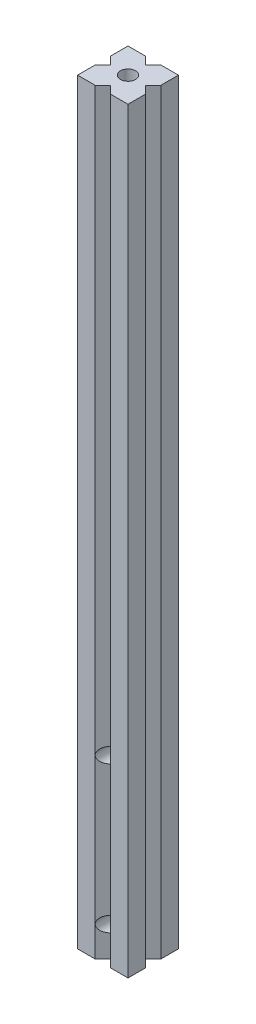
ISO-10303-21;
HEADER;
FILE_DESCRIPTION(('STEP AP214'),'2;1');
FILE_NAME('part.step','',(''),(''),'','','');
FILE_SCHEMA(('AUTOMOTIVE_DESIGN { 1 0 10303 214 1 1 1 1 }'));
ENDSEC;
DATA;
#1=APPLICATION_CONTEXT('core data for automotive mechanical design processes');
#2=APPLICATION_PROTOCOL_DEFINITION('international standard','automotive_design',2000,#1);
#3=PRODUCT_CONTEXT('',#1,'mechanical');
#4=PRODUCT('Part','Part','',(#3));
#5=PRODUCT_RELATED_PRODUCT_CATEGORY('part','',(#4));
#6=PRODUCT_DEFINITION_FORMATION('','',#4);
#7=PRODUCT_DEFINITION_CONTEXT('part definition',#1,'design');
#8=PRODUCT_DEFINITION('design','',#6,#7);
#9=PRODUCT_DEFINITION_SHAPE('','',#8);
#10=(LENGTH_UNIT() NAMED_UNIT(*) SI_UNIT(.MILLI.,.METRE.));
#11=(NAMED_UNIT(*) PLANE_ANGLE_UNIT() SI_UNIT($,.RADIAN.));
#12=(NAMED_UNIT(*) SI_UNIT($,.STERADIAN.) SOLID_ANGLE_UNIT());
#13=UNCERTAINTY_MEASURE_WITH_UNIT(LENGTH_MEASURE(1.E-05),#10,'distance_accuracy_value','');
#14=(GEOMETRIC_REPRESENTATION_CONTEXT(3) GLOBAL_UNCERTAINTY_ASSIGNED_CONTEXT((#13)) GLOBAL_UNIT_ASSIGNED_CONTEXT((#10,
#11,#12)) REPRESENTATION_CONTEXT('',''));
#15=CARTESIAN_POINT('',(0.,0.,0.));
#16=DIRECTION('',(0.,0.,1.));
#17=DIRECTION('',(1.,0.,0.));
#18=AXIS2_PLACEMENT_3D('',#15,#16,#17);
#19=CARTESIAN_POINT('',(7.,0.,0.));
#20=DIRECTION('',(-0.707106781186548,0.,-0.707106781186547));
#21=DIRECTION('',(-0.707106781186547,0.,0.707106781186548));
#22=AXIS2_PLACEMENT_3D('',#19,#20,#21);
#23=PLANE('',#22);
#24=DIRECTION('',(0.,1.,0.));
#25=VECTOR('',#24,1.);
#26=CARTESIAN_POINT('',(7.,0.,0.));
#27=LINE('',#26,#25);
#28=CARTESIAN_POINT('',(7.,12.,0.));
#29=VERTEX_POINT('',#28);
#30=CARTESIAN_POINT('',(7.,70.,0.));
#31=VERTEX_POINT('',#30);
#32=EDGE_CURVE('E349',#29,#31,#27,.T.);
#33=ORIENTED_EDGE('',*,*,#32,.F.);
#34=CARTESIAN_POINT('',(10.,12.,-3.));
#35=DIRECTION('',(-0.707106781186548,0.,-0.707106781186547));
#36=DIRECTION('',(-0.707106781186547,0.,0.707106781186548));
#37=AXIS2_PLACEMENT_3D('',#34,#35,#36);
#38=ELLIPSE('',#37,4.24264068711929,3.);
#39=CARTESIAN_POINT('',(10.,15.,-3.));
#40=VERTEX_POINT('',#39);
#41=EDGE_CURVE('E849',#29,#40,#38,.T.);
#42=ORIENTED_EDGE('',*,*,#41,.T.);
#43=DIRECTION('',(0.,1.,0.));
#44=VECTOR('',#43,1.);
#45=CARTESIAN_POINT('',(10.,0.,-3.));
#46=LINE('',#45,#44);
#47=CARTESIAN_POINT('',(10.,67.,-3.));
#48=VERTEX_POINT('',#47);
#49=EDGE_CURVE('E337',#40,#48,#46,.T.);
#50=ORIENTED_EDGE('',*,*,#49,.T.);
#51=CARTESIAN_POINT('',(10.,70.,-3.));
#52=DIRECTION('',(-0.707106781186548,0.,-0.707106781186547));
#53=DIRECTION('',(-0.707106781186547,0.,0.707106781186548));
#54=AXIS2_PLACEMENT_3D('',#51,#52,#53);
#55=ELLIPSE('',#54,4.24264068711929,3.);
#56=EDGE_CURVE('E863',#48,#31,#55,.T.);
#57=ORIENTED_EDGE('',*,*,#56,.T.);
#58=EDGE_LOOP('',(#33,#42,#50,#57));
#59=FACE_BOUND('',#58,.T.);
#60=ADVANCED_FACE('F43',(#59),#23,.F.);
#61=CARTESIAN_POINT('',(7.,300.,0.));
#62=VERTEX_POINT('',#61);
#63=EDGE_CURVE('E325',#31,#62,#27,.T.);
#64=ORIENTED_EDGE('',*,*,#63,.F.);
#65=CARTESIAN_POINT('',(10.,73.,-3.));
#66=VERTEX_POINT('',#65);
#67=EDGE_CURVE('E862',#31,#66,#55,.T.);
#68=ORIENTED_EDGE('',*,*,#67,.T.);
#69=CARTESIAN_POINT('',(10.,300.,-3.));
#70=VERTEX_POINT('',#69);
#71=EDGE_CURVE('E338',#66,#70,#46,.T.);
#72=ORIENTED_EDGE('',*,*,#71,.T.);
#73=DIRECTION('',(-0.707106781186547,0.,0.707106781186548));
#74=VECTOR('',#73,1.);
#75=CARTESIAN_POINT('',(7.,300.,0.));
#76=LINE('',#75,#74);
#77=EDGE_CURVE('E326',#70,#62,#76,.T.);
#78=ORIENTED_EDGE('',*,*,#77,.T.);
#79=EDGE_LOOP('',(#64,#68,#72,#78));
#80=FACE_BOUND('',#79,.T.);
#81=ADVANCED_FACE('F448',(#80),#23,.F.);
#82=CARTESIAN_POINT('',(13.,0.,0.));
#83=DIRECTION('',(0.707106781186548,0.,-0.707106781186547));
#84=DIRECTION('',(-0.707106781186547,0.,-0.707106781186548));
#85=AXIS2_PLACEMENT_3D('',#82,#83,#84);
#86=PLANE('',#85);
#87=DIRECTION('',(0.,1.,0.));
#88=VECTOR('',#87,1.);
#89=CARTESIAN_POINT('',(13.,0.,0.));
#90=LINE('',#89,#88);
#91=CARTESIAN_POINT('',(13.,0.,0.));
#92=VERTEX_POINT('',#91);
#93=CARTESIAN_POINT('',(13.,12.,0.));
#94=VERTEX_POINT('',#93);
#95=EDGE_CURVE('E339',#92,#94,#90,.T.);
#96=ORIENTED_EDGE('',*,*,#95,.T.);
#97=CARTESIAN_POINT('',(10.,12.,-3.));
#98=DIRECTION('',(0.707106781186548,0.,-0.707106781186547));
#99=DIRECTION('',(0.707106781186547,0.,0.707106781186548));
#100=AXIS2_PLACEMENT_3D('',#97,#98,#99);
#101=ELLIPSE('',#100,4.24264068711929,3.);
#102=CARTESIAN_POINT('',(10.,9.,-3.));
#103=VERTEX_POINT('',#102);
#104=EDGE_CURVE('E483',#94,#103,#101,.T.);
#105=ORIENTED_EDGE('',*,*,#104,.T.);
#106=CARTESIAN_POINT('',(10.,0.,-3.));
#107=VERTEX_POINT('',#106);
#108=EDGE_CURVE('E305',#107,#103,#46,.T.);
#109=ORIENTED_EDGE('',*,*,#108,.F.);
#110=DIRECTION('',(-0.707106781186547,0.,-0.707106781186548));
#111=VECTOR('',#110,1.);
#112=CARTESIAN_POINT('',(13.,0.,0.));
#113=LINE('',#112,#111);
#114=EDGE_CURVE('E320',#92,#107,#113,.T.);
#115=ORIENTED_EDGE('',*,*,#114,.F.);
#116=EDGE_LOOP('',(#96,#105,#109,#115));
#117=FACE_BOUND('',#116,.T.);
#118=ADVANCED_FACE('F457',(#117),#86,.F.);
#119=ORIENTED_EDGE('',*,*,#49,.F.);
#120=EDGE_CURVE('E853',#40,#94,#101,.T.);
#121=ORIENTED_EDGE('',*,*,#120,.T.);
#122=CARTESIAN_POINT('',(13.,70.,0.));
#123=VERTEX_POINT('',#122);
#124=EDGE_CURVE('E343',#94,#123,#90,.T.);
#125=ORIENTED_EDGE('',*,*,#124,.T.);
#126=CARTESIAN_POINT('',(10.,70.,-3.));
#127=DIRECTION('',(0.707106781186548,0.,-0.707106781186547));
#128=DIRECTION('',(0.707106781186547,0.,0.707106781186548));
#129=AXIS2_PLACEMENT_3D('',#126,#127,#128);
#130=ELLIPSE('',#129,4.24264068711929,3.);
#131=EDGE_CURVE('E866',#123,#48,#130,.T.);
#132=ORIENTED_EDGE('',*,*,#131,.T.);
#133=EDGE_LOOP('',(#119,#121,#125,#132));
#134=FACE_BOUND('',#133,.T.);
#135=ADVANCED_FACE('F472',(#134),#86,.F.);
#136=CARTESIAN_POINT('',(13.,0.,-20.));
#137=DIRECTION('',(0.707106781186547,0.,0.707106781186548));
#138=DIRECTION('',(0.707106781186548,0.,-0.707106781186547));
#139=AXIS2_PLACEMENT_3D('',#136,#137,#138);
#140=PLANE('',#139);
#141=DIRECTION('',(0.,1.,0.));
#142=VECTOR('',#141,1.);
#143=CARTESIAN_POINT('',(10.,0.,-17.));
#144=LINE('',#143,#142);
#145=CARTESIAN_POINT('',(10.,0.,-17.));
#146=VERTEX_POINT('',#145);
#147=CARTESIAN_POINT('',(10.,9.,-17.));
#148=VERTEX_POINT('',#147);
#149=EDGE_CURVE('E246',#146,#148,#144,.T.);
#150=ORIENTED_EDGE('',*,*,#149,.T.);
#151=CARTESIAN_POINT('',(10.,12.,-17.));
#152=DIRECTION('',(0.707106781186547,0.,0.707106781186548));
#153=DIRECTION('',(-0.707106781186548,0.,0.707106781186547));
#154=AXIS2_PLACEMENT_3D('',#151,#152,#153);
#155=ELLIPSE('',#154,4.24264068711929,3.);
#156=CARTESIAN_POINT('',(13.,12.,-20.));
#157=VERTEX_POINT('',#156);
#158=EDGE_CURVE('E856',#148,#157,#155,.T.);
#159=ORIENTED_EDGE('',*,*,#158,.T.);
#160=DIRECTION('',(0.,1.,0.));
#161=VECTOR('',#160,1.);
#162=CARTESIAN_POINT('',(13.,0.,-20.));
#163=LINE('',#162,#161);
#164=CARTESIAN_POINT('',(13.,0.,-20.));
#165=VERTEX_POINT('',#164);
#166=EDGE_CURVE('E248',#165,#157,#163,.T.);
#167=ORIENTED_EDGE('',*,*,#166,.F.);
#168=DIRECTION('',(0.707106781186548,0.,-0.707106781186547));
#169=VECTOR('',#168,1.);
#170=CARTESIAN_POINT('',(13.,0.,-20.));
#171=LINE('',#170,#169);
#172=EDGE_CURVE('E837',#146,#165,#171,.T.);
#173=ORIENTED_EDGE('',*,*,#172,.F.);
#174=EDGE_LOOP('',(#150,#159,#167,#173));
#175=FACE_BOUND('',#174,.T.);
#176=ADVANCED_FACE('F657',(#175),#140,.F.);
#177=CARTESIAN_POINT('',(13.,70.,-20.));
#178=VERTEX_POINT('',#177);
#179=EDGE_CURVE('E233',#157,#178,#163,.T.);
#180=ORIENTED_EDGE('',*,*,#179,.F.);
#181=CARTESIAN_POINT('',(10.,15.,-17.));
#182=VERTEX_POINT('',#181);
#183=EDGE_CURVE('E857',#157,#182,#155,.T.);
#184=ORIENTED_EDGE('',*,*,#183,.T.);
#185=CARTESIAN_POINT('',(10.,67.,-17.));
#186=VERTEX_POINT('',#185);
#187=EDGE_CURVE('E236',#182,#186,#144,.T.);
#188=ORIENTED_EDGE('',*,*,#187,.T.);
#189=CARTESIAN_POINT('',(10.,70.,-17.));
#190=DIRECTION('',(0.707106781186547,0.,0.707106781186548));
#191=DIRECTION('',(-0.707106781186548,0.,0.707106781186547));
#192=AXIS2_PLACEMENT_3D('',#189,#190,#191);
#193=ELLIPSE('',#192,4.24264068711929,3.);
#194=EDGE_CURVE('E219',#186,#178,#193,.T.);
#195=ORIENTED_EDGE('',*,*,#194,.T.);
#196=EDGE_LOOP('',(#180,#184,#188,#195));
#197=FACE_BOUND('',#196,.T.);
#198=ADVANCED_FACE('F230',(#197),#140,.F.);
#199=CARTESIAN_POINT('',(7.,0.,-20.));
#200=DIRECTION('',(-0.707106781186547,0.,0.707106781186548));
#201=DIRECTION('',(0.707106781186548,0.,0.707106781186547));
#202=AXIS2_PLACEMENT_3D('',#199,#200,#201);
#203=PLANE('',#202);
#204=ORIENTED_EDGE('',*,*,#187,.F.);
#205=CARTESIAN_POINT('',(10.,12.,-17.));
#206=DIRECTION('',(-0.707106781186547,0.,0.707106781186548));
#207=DIRECTION('',(0.707106781186548,0.,0.707106781186547));
#208=AXIS2_PLACEMENT_3D('',#205,#206,#207);
#209=ELLIPSE('',#208,4.24264068711929,3.);
#210=CARTESIAN_POINT('',(7.,12.,-20.));
#211=VERTEX_POINT('',#210);
#212=EDGE_CURVE('E824',#182,#211,#209,.T.);
#213=ORIENTED_EDGE('',*,*,#212,.T.);
#214=DIRECTION('',(0.,1.,0.));
#215=VECTOR('',#214,1.);
#216=CARTESIAN_POINT('',(7.,0.,-20.));
#217=LINE('',#216,#215);
#218=CARTESIAN_POINT('',(7.,70.,-20.));
#219=VERTEX_POINT('',#218);
#220=EDGE_CURVE('E264',#211,#219,#217,.T.);
#221=ORIENTED_EDGE('',*,*,#220,.T.);
#222=CARTESIAN_POINT('',(10.,70.,-17.));
#223=DIRECTION('',(-0.707106781186547,0.,0.707106781186548));
#224=DIRECTION('',(0.707106781186548,0.,0.707106781186547));
#225=AXIS2_PLACEMENT_3D('',#222,#223,#224);
#226=ELLIPSE('',#225,4.24264068711929,3.);
#227=EDGE_CURVE('E826',#219,#186,#226,.T.);
#228=ORIENTED_EDGE('',*,*,#227,.T.);
#229=EDGE_LOOP('',(#204,#213,#221,#228));
#230=FACE_BOUND('',#229,.T.);
#231=ADVANCED_FACE('F648',(#230),#203,.F.);
#232=CARTESIAN_POINT('',(10.,73.,-17.));
#233=VERTEX_POINT('',#232);
#234=CARTESIAN_POINT('',(10.,300.,-17.));
#235=VERTEX_POINT('',#234);
#236=EDGE_CURVE('E259',#233,#235,#144,.T.);
#237=ORIENTED_EDGE('',*,*,#236,.F.);
#238=EDGE_CURVE('E222',#233,#219,#226,.T.);
#239=ORIENTED_EDGE('',*,*,#238,.T.);
#240=CARTESIAN_POINT('',(7.,300.,-20.));
#241=VERTEX_POINT('',#240);
#242=EDGE_CURVE('E265',#219,#241,#217,.T.);
#243=ORIENTED_EDGE('',*,*,#242,.T.);
#244=DIRECTION('',(0.707106781186548,0.,0.707106781186547));
#245=VECTOR('',#244,1.);
#246=CARTESIAN_POINT('',(7.,300.,-20.));
#247=LINE('',#246,#245);
#248=EDGE_CURVE('E287',#241,#235,#247,.T.);
#249=ORIENTED_EDGE('',*,*,#248,.T.);
#250=EDGE_LOOP('',(#237,#239,#243,#249));
#251=FACE_BOUND('',#250,.T.);
#252=ADVANCED_FACE('F443',(#251),#203,.F.);
#253=CARTESIAN_POINT('',(10.,0.,-10.));
#254=DIRECTION('',(0.,1.,0.));
#255=DIRECTION('',(0.,0.,1.));
#256=AXIS2_PLACEMENT_3D('',#253,#254,#255);
#257=CYLINDRICAL_SURFACE('',#256,3.);
#258=CARTESIAN_POINT('',(10.,300.,-10.));
#259=DIRECTION('',(0.,1.,0.));
#260=DIRECTION('',(0.,0.,1.));
#261=AXIS2_PLACEMENT_3D('',#258,#259,#260);
#262=CIRCLE('',#261,3.);
#263=CARTESIAN_POINT('',(10.,300.,-7.));
#264=VERTEX_POINT('',#263);
#265=EDGE_CURVE('E846',#264,#264,#262,.T.);
#266=ORIENTED_EDGE('',*,*,#265,.T.);
#267=EDGE_LOOP('',(#266));
#268=FACE_BOUND('',#267,.T.);
#269=CARTESIAN_POINT('',(10.,70.,-10.));
#270=DIRECTION('',(0.,0.707106781186547,-0.707106781186547));
#271=DIRECTION('',(0.,0.707106781186547,0.707106781186547));
#272=AXIS2_PLACEMENT_3D('',#269,#270,#271);
#273=ELLIPSE('',#272,4.24264068711929,3.);
#274=CARTESIAN_POINT('',(13.,70.,-10.));
#275=VERTEX_POINT('',#274);
#276=CARTESIAN_POINT('',(7.,70.,-10.));
#277=VERTEX_POINT('',#276);
#278=EDGE_CURVE('E63',#275,#277,#273,.F.);
#279=ORIENTED_EDGE('',*,*,#278,.T.);
#280=CARTESIAN_POINT('',(10.,70.,-10.));
#281=DIRECTION('',(0.,0.707106781186547,0.707106781186547));
#282=DIRECTION('',(0.,0.707106781186547,-0.707106781186547));
#283=AXIS2_PLACEMENT_3D('',#280,#281,#282);
#284=ELLIPSE('',#283,4.24264068711929,3.);
#285=EDGE_CURVE('E410',#277,#275,#284,.F.);
#286=ORIENTED_EDGE('',*,*,#285,.T.);
#287=EDGE_LOOP('',(#279,#286));
#288=FACE_BOUND('',#287,.T.);
#289=ADVANCED_FACE('F431',(#268,#288),#257,.F.);
#290=CARTESIAN_POINT('',(0.,300.,0.));
#291=DIRECTION('',(1.,0.,0.));
#292=DIRECTION('',(0.,0.,-1.));
#293=AXIS2_PLACEMENT_3D('',#290,#291,#292);
#294=PLANE('',#293);
#295=DIRECTION('',(0.,0.,1.));
#296=VECTOR('',#295,1.);
#297=CARTESIAN_POINT('',(0.,300.,0.));
#298=LINE('',#297,#296);
#299=CARTESIAN_POINT('',(0.,300.,-7.));
#300=VERTEX_POINT('',#299);
#301=CARTESIAN_POINT('',(0.,300.,0.));
#302=VERTEX_POINT('',#301);
#303=EDGE_CURVE('E355',#300,#302,#298,.T.);
#304=ORIENTED_EDGE('',*,*,#303,.F.);
#305=DIRECTION('',(0.,1.,0.));
#306=VECTOR('',#305,1.);
#307=CARTESIAN_POINT('',(0.,0.,-7.));
#308=LINE('',#307,#306);
#309=CARTESIAN_POINT('',(0.,0.,-7.));
#310=VERTEX_POINT('',#309);
#311=EDGE_CURVE('E280',#310,#300,#308,.T.);
#312=ORIENTED_EDGE('',*,*,#311,.F.);
#313=DIRECTION('',(0.,0.,1.));
#314=VECTOR('',#313,1.);
#315=CARTESIAN_POINT('',(0.,0.,0.));
#316=LINE('',#315,#314);
#317=CARTESIAN_POINT('',(0.,0.,0.));
#318=VERTEX_POINT('',#317);
#319=EDGE_CURVE('E252',#310,#318,#316,.T.);
#320=ORIENTED_EDGE('',*,*,#319,.T.);
#321=DIRECTION('',(0.,-1.,0.));
#322=VECTOR('',#321,1.);
#323=CARTESIAN_POINT('',(0.,300.,0.));
#324=LINE('',#323,#322);
#325=EDGE_CURVE('E399',#302,#318,#324,.T.);
#326=ORIENTED_EDGE('',*,*,#325,.F.);
#327=EDGE_LOOP('',(#304,#312,#320,#326));
#328=FACE_BOUND('',#327,.T.);
#329=ADVANCED_FACE('F442',(#328),#294,.F.);
#330=CARTESIAN_POINT('',(0.,300.,0.));
#331=DIRECTION('',(0.,0.,-1.));
#332=DIRECTION('',(-1.,0.,0.));
#333=AXIS2_PLACEMENT_3D('',#330,#331,#332);
#334=PLANE('',#333);
#335=DIRECTION('',(1.,0.,0.));
#336=VECTOR('',#335,1.);
#337=CARTESIAN_POINT('',(0.,0.,0.));
#338=LINE('',#337,#336);
#339=CARTESIAN_POINT('',(7.,0.,0.));
#340=VERTEX_POINT('',#339);
#341=EDGE_CURVE('E375',#318,#340,#338,.T.);
#342=ORIENTED_EDGE('',*,*,#341,.T.);
#343=EDGE_CURVE('E345',#340,#29,#27,.T.);
#344=ORIENTED_EDGE('',*,*,#343,.T.);
#345=ORIENTED_EDGE('',*,*,#32,.T.);
#346=ORIENTED_EDGE('',*,*,#63,.T.);
#347=DIRECTION('',(1.,0.,0.));
#348=VECTOR('',#347,1.);
#349=CARTESIAN_POINT('',(0.,300.,0.));
#350=LINE('',#349,#348);
#351=EDGE_CURVE('E356',#302,#62,#350,.T.);
#352=ORIENTED_EDGE('',*,*,#351,.F.);
#353=ORIENTED_EDGE('',*,*,#325,.T.);
#354=EDGE_LOOP('',(#342,#344,#345,#346,#352,#353));
#355=FACE_BOUND('',#354,.T.);
#356=ADVANCED_FACE('F501',(#355),#334,.F.);
#357=CARTESIAN_POINT('',(20.,300.,0.));
#358=DIRECTION('',(-1.,0.,0.));
#359=DIRECTION('',(0.,0.,1.));
#360=AXIS2_PLACEMENT_3D('',#357,#358,#359);
#361=PLANE('',#360);
#362=DIRECTION('',(0.,0.,-1.));
#363=VECTOR('',#362,1.);
#364=CARTESIAN_POINT('',(20.,0.,0.));
#365=LINE('',#364,#363);
#366=CARTESIAN_POINT('',(20.,0.,0.));
#367=VERTEX_POINT('',#366);
#368=CARTESIAN_POINT('',(20.,0.,-7.));
#369=VERTEX_POINT('',#368);
#370=EDGE_CURVE('E380',#367,#369,#365,.T.);
#371=ORIENTED_EDGE('',*,*,#370,.T.);
#372=DIRECTION('',(0.,1.,0.));
#373=VECTOR('',#372,1.);
#374=CARTESIAN_POINT('',(20.,0.,-7.));
#375=LINE('',#374,#373);
#376=CARTESIAN_POINT('',(20.,300.,-7.));
#377=VERTEX_POINT('',#376);
#378=EDGE_CURVE('E283',#369,#377,#375,.T.);
#379=ORIENTED_EDGE('',*,*,#378,.T.);
#380=DIRECTION('',(0.,0.,-1.));
#381=VECTOR('',#380,1.);
#382=CARTESIAN_POINT('',(20.,300.,0.));
#383=LINE('',#382,#381);
#384=CARTESIAN_POINT('',(20.,300.,0.));
#385=VERTEX_POINT('',#384);
#386=EDGE_CURVE('E361',#385,#377,#383,.T.);
#387=ORIENTED_EDGE('',*,*,#386,.F.);
#388=DIRECTION('',(0.,-1.,0.));
#389=VECTOR('',#388,1.);
#390=CARTESIAN_POINT('',(20.,300.,0.));
#391=LINE('',#390,#389);
#392=EDGE_CURVE('E395',#385,#367,#391,.T.);
#393=ORIENTED_EDGE('',*,*,#392,.T.);
#394=EDGE_LOOP('',(#371,#379,#387,#393));
#395=FACE_BOUND('',#394,.T.);
#396=ADVANCED_FACE('F520',(#395),#361,.F.);
#397=CARTESIAN_POINT('',(0.,300.,-20.));
#398=DIRECTION('',(0.,0.,1.));
#399=DIRECTION('',(1.,0.,0.));
#400=AXIS2_PLACEMENT_3D('',#397,#398,#399);
#401=PLANE('',#400);
#402=DIRECTION('',(-1.,0.,0.));
#403=VECTOR('',#402,1.);
#404=CARTESIAN_POINT('',(0.,0.,-20.));
#405=LINE('',#404,#403);
#406=CARTESIAN_POINT('',(20.,0.,-20.));
#407=VERTEX_POINT('',#406);
#408=EDGE_CURVE('E385',#407,#165,#405,.T.);
#409=ORIENTED_EDGE('',*,*,#408,.T.);
#410=ORIENTED_EDGE('',*,*,#166,.T.);
#411=ORIENTED_EDGE('',*,*,#179,.T.);
#412=CARTESIAN_POINT('',(13.,300.,-20.));
#413=VERTEX_POINT('',#412);
#414=EDGE_CURVE('E239',#178,#413,#163,.T.);
#415=ORIENTED_EDGE('',*,*,#414,.T.);
#416=DIRECTION('',(-1.,0.,0.));
#417=VECTOR('',#416,1.);
#418=CARTESIAN_POINT('',(0.,300.,-20.));
#419=LINE('',#418,#417);
#420=CARTESIAN_POINT('',(20.,300.,-20.));
#421=VERTEX_POINT('',#420);
#422=EDGE_CURVE('E366',#421,#413,#419,.T.);
#423=ORIENTED_EDGE('',*,*,#422,.F.);
#424=DIRECTION('',(0.,-1.,0.));
#425=VECTOR('',#424,1.);
#426=CARTESIAN_POINT('',(20.,300.,-20.));
#427=LINE('',#426,#425);
#428=EDGE_CURVE('E391',#421,#407,#427,.T.);
#429=ORIENTED_EDGE('',*,*,#428,.T.);
#430=EDGE_LOOP('',(#409,#410,#411,#415,#423,#429));
#431=FACE_BOUND('',#430,.T.);
#432=ADVANCED_FACE('F250',(#431),#401,.F.);
#433=CARTESIAN_POINT('',(0.,0.,-20.));
#434=VERTEX_POINT('',#433);
#435=CARTESIAN_POINT('',(0.,0.,-13.));
#436=VERTEX_POINT('',#435);
#437=EDGE_CURVE('E370',#434,#436,#316,.T.);
#438=ORIENTED_EDGE('',*,*,#437,.T.);
#439=DIRECTION('',(0.,1.,0.));
#440=VECTOR('',#439,1.);
#441=CARTESIAN_POINT('',(0.,0.,-13.));
#442=LINE('',#441,#440);
#443=CARTESIAN_POINT('',(0.,300.,-13.));
#444=VERTEX_POINT('',#443);
#445=EDGE_CURVE('E310',#436,#444,#442,.T.);
#446=ORIENTED_EDGE('',*,*,#445,.T.);
#447=CARTESIAN_POINT('',(0.,300.,-20.));
#448=VERTEX_POINT('',#447);
#449=EDGE_CURVE('E350',#448,#444,#298,.T.);
#450=ORIENTED_EDGE('',*,*,#449,.F.);
#451=DIRECTION('',(0.,-1.,0.));
#452=VECTOR('',#451,1.);
#453=CARTESIAN_POINT('',(0.,300.,-20.));
#454=LINE('',#453,#452);
#455=EDGE_CURVE('E369',#448,#434,#454,.T.);
#456=ORIENTED_EDGE('',*,*,#455,.T.);
#457=EDGE_LOOP('',(#438,#446,#450,#456));
#458=FACE_BOUND('',#457,.T.);
#459=ADVANCED_FACE('F45',(#458),#294,.F.);
#460=CARTESIAN_POINT('',(13.,300.,0.));
#461=VERTEX_POINT('',#460);
#462=EDGE_CURVE('E354',#461,#385,#350,.T.);
#463=ORIENTED_EDGE('',*,*,#462,.F.);
#464=EDGE_CURVE('E344',#123,#461,#90,.T.);
#465=ORIENTED_EDGE('',*,*,#464,.F.);
#466=ORIENTED_EDGE('',*,*,#124,.F.);
#467=ORIENTED_EDGE('',*,*,#95,.F.);
#468=EDGE_CURVE('E374',#92,#367,#338,.T.);
#469=ORIENTED_EDGE('',*,*,#468,.T.);
#470=ORIENTED_EDGE('',*,*,#392,.F.);
#471=EDGE_LOOP('',(#463,#465,#466,#467,#469,#470));
#472=FACE_BOUND('',#471,.T.);
#473=ADVANCED_FACE('F509',(#472),#334,.F.);
#474=CARTESIAN_POINT('',(20.,300.,-13.));
#475=VERTEX_POINT('',#474);
#476=EDGE_CURVE('E360',#475,#421,#383,.T.);
#477=ORIENTED_EDGE('',*,*,#476,.F.);
#478=DIRECTION('',(0.,1.,0.));
#479=VECTOR('',#478,1.);
#480=CARTESIAN_POINT('',(20.,0.,-13.));
#481=LINE('',#480,#479);
#482=CARTESIAN_POINT('',(20.,0.,-13.));
#483=VERTEX_POINT('',#482);
#484=EDGE_CURVE('E275',#483,#475,#481,.T.);
#485=ORIENTED_EDGE('',*,*,#484,.F.);
#486=EDGE_CURVE('E379',#483,#407,#365,.T.);
#487=ORIENTED_EDGE('',*,*,#486,.T.);
#488=ORIENTED_EDGE('',*,*,#428,.F.);
#489=EDGE_LOOP('',(#477,#485,#487,#488));
#490=FACE_BOUND('',#489,.T.);
#491=ADVANCED_FACE('F514',(#490),#361,.F.);
#492=EDGE_CURVE('E365',#241,#448,#419,.T.);
#493=ORIENTED_EDGE('',*,*,#492,.F.);
#494=ORIENTED_EDGE('',*,*,#242,.F.);
#495=ORIENTED_EDGE('',*,*,#220,.F.);
#496=CARTESIAN_POINT('',(7.,0.,-20.));
#497=VERTEX_POINT('',#496);
#498=EDGE_CURVE('E260',#497,#211,#217,.T.);
#499=ORIENTED_EDGE('',*,*,#498,.F.);
#500=EDGE_CURVE('E384',#497,#434,#405,.T.);
#501=ORIENTED_EDGE('',*,*,#500,.T.);
#502=ORIENTED_EDGE('',*,*,#455,.F.);
#503=EDGE_LOOP('',(#493,#494,#495,#499,#501,#502));
#504=FACE_BOUND('',#503,.T.);
#505=ADVANCED_FACE('F517',(#504),#401,.F.);
#506=CARTESIAN_POINT('',(0.,300.,0.));
#507=DIRECTION('',(0.,-1.,0.));
#508=DIRECTION('',(0.,0.,-1.));
#509=AXIS2_PLACEMENT_3D('',#506,#507,#508);
#510=PLANE('',#509);
#511=ORIENTED_EDGE('',*,*,#265,.F.);
#512=EDGE_LOOP('',(#511));
#513=FACE_BOUND('',#512,.T.);
#514=ORIENTED_EDGE('',*,*,#422,.T.);
#515=DIRECTION('',(0.707106781186548,0.,-0.707106781186547));
#516=VECTOR('',#515,1.);
#517=CARTESIAN_POINT('',(13.,300.,-20.));
#518=LINE('',#517,#516);
#519=EDGE_CURVE('E242',#235,#413,#518,.T.);
#520=ORIENTED_EDGE('',*,*,#519,.F.);
#521=ORIENTED_EDGE('',*,*,#248,.F.);
#522=ORIENTED_EDGE('',*,*,#492,.T.);
#523=ORIENTED_EDGE('',*,*,#449,.T.);
#524=DIRECTION('',(-0.707106781186547,0.,-0.707106781186548));
#525=VECTOR('',#524,1.);
#526=CARTESIAN_POINT('',(0.,300.,-13.));
#527=LINE('',#526,#525);
#528=CARTESIAN_POINT('',(2.99999999999999,300.,-10.));
#529=VERTEX_POINT('',#528);
#530=EDGE_CURVE('E297',#529,#444,#527,.T.);
#531=ORIENTED_EDGE('',*,*,#530,.F.);
#532=DIRECTION('',(0.707106781186548,0.,-0.707106781186547));
#533=VECTOR('',#532,1.);
#534=CARTESIAN_POINT('',(0.,300.,-7.));
#535=LINE('',#534,#533);
#536=EDGE_CURVE('E302',#300,#529,#535,.T.);
#537=ORIENTED_EDGE('',*,*,#536,.F.);
#538=ORIENTED_EDGE('',*,*,#303,.T.);
#539=ORIENTED_EDGE('',*,*,#351,.T.);
#540=ORIENTED_EDGE('',*,*,#77,.F.);
#541=DIRECTION('',(-0.707106781186547,0.,-0.707106781186548));
#542=VECTOR('',#541,1.);
#543=CARTESIAN_POINT('',(13.,300.,0.));
#544=LINE('',#543,#542);
#545=EDGE_CURVE('E321',#461,#70,#544,.T.);
#546=ORIENTED_EDGE('',*,*,#545,.F.);
#547=ORIENTED_EDGE('',*,*,#462,.T.);
#548=ORIENTED_EDGE('',*,*,#386,.T.);
#549=DIRECTION('',(0.707106781186548,0.,0.707106781186547));
#550=VECTOR('',#549,1.);
#551=CARTESIAN_POINT('',(20.,300.,-7.));
#552=LINE('',#551,#550);
#553=CARTESIAN_POINT('',(17.,300.,-10.));
#554=VERTEX_POINT('',#553);
#555=EDGE_CURVE('E271',#554,#377,#552,.T.);
#556=ORIENTED_EDGE('',*,*,#555,.F.);
#557=DIRECTION('',(-0.707106781186547,0.,0.707106781186548));
#558=VECTOR('',#557,1.);
#559=CARTESIAN_POINT('',(20.,300.,-13.));
#560=LINE('',#559,#558);
#561=EDGE_CURVE('E276',#475,#554,#560,.T.);
#562=ORIENTED_EDGE('',*,*,#561,.F.);
#563=ORIENTED_EDGE('',*,*,#476,.T.);
#564=EDGE_LOOP('',(#514,#520,#521,#522,#523,#531,#537,#538,#539,#540,#546,#547,#548,#556,#562,#563));
#565=FACE_BOUND('',#564,.T.);
#566=ADVANCED_FACE('F474',(#513,#565),#510,.F.);
#567=CARTESIAN_POINT('',(0.,0.,0.));
#568=DIRECTION('',(0.,-1.,0.));
#569=DIRECTION('',(0.,0.,-1.));
#570=AXIS2_PLACEMENT_3D('',#567,#568,#569);
#571=PLANE('',#570);
#572=CARTESIAN_POINT('',(10.,0.,-10.));
#573=DIRECTION('',(0.,1.,0.));
#574=DIRECTION('',(0.,0.,1.));
#575=AXIS2_PLACEMENT_3D('',#572,#573,#574);
#576=CIRCLE('',#575,3.);
#577=CARTESIAN_POINT('',(10.,0.,-7.));
#578=VERTEX_POINT('',#577);
#579=EDGE_CURVE('E330',#578,#578,#576,.T.);
#580=ORIENTED_EDGE('',*,*,#579,.T.);
#581=EDGE_LOOP('',(#580));
#582=FACE_BOUND('',#581,.T.);
#583=ORIENTED_EDGE('',*,*,#172,.T.);
#584=ORIENTED_EDGE('',*,*,#408,.F.);
#585=ORIENTED_EDGE('',*,*,#486,.F.);
#586=DIRECTION('',(-0.707106781186547,0.,0.707106781186548));
#587=VECTOR('',#586,1.);
#588=CARTESIAN_POINT('',(20.,0.,-13.));
#589=LINE('',#588,#587);
#590=CARTESIAN_POINT('',(17.,0.,-10.));
#591=VERTEX_POINT('',#590);
#592=EDGE_CURVE('E266',#483,#591,#589,.T.);
#593=ORIENTED_EDGE('',*,*,#592,.T.);
#594=DIRECTION('',(0.707106781186548,0.,0.707106781186547));
#595=VECTOR('',#594,1.);
#596=CARTESIAN_POINT('',(20.,0.,-7.));
#597=LINE('',#596,#595);
#598=EDGE_CURVE('E270',#591,#369,#597,.T.);
#599=ORIENTED_EDGE('',*,*,#598,.T.);
#600=ORIENTED_EDGE('',*,*,#370,.F.);
#601=ORIENTED_EDGE('',*,*,#468,.F.);
#602=ORIENTED_EDGE('',*,*,#114,.T.);
#603=DIRECTION('',(-0.707106781186547,0.,0.707106781186548));
#604=VECTOR('',#603,1.);
#605=CARTESIAN_POINT('',(7.,0.,0.));
#606=LINE('',#605,#604);
#607=EDGE_CURVE('E316',#107,#340,#606,.T.);
#608=ORIENTED_EDGE('',*,*,#607,.T.);
#609=ORIENTED_EDGE('',*,*,#341,.F.);
#610=ORIENTED_EDGE('',*,*,#319,.F.);
#611=DIRECTION('',(0.707106781186548,0.,-0.707106781186547));
#612=VECTOR('',#611,1.);
#613=CARTESIAN_POINT('',(0.,0.,-7.));
#614=LINE('',#613,#612);
#615=CARTESIAN_POINT('',(2.99999999999999,0.,-10.));
#616=VERTEX_POINT('',#615);
#617=EDGE_CURVE('E293',#310,#616,#614,.T.);
#618=ORIENTED_EDGE('',*,*,#617,.T.);
#619=DIRECTION('',(-0.707106781186547,0.,-0.707106781186548));
#620=VECTOR('',#619,1.);
#621=CARTESIAN_POINT('',(0.,0.,-13.));
#622=LINE('',#621,#620);
#623=EDGE_CURVE('E296',#616,#436,#622,.T.);
#624=ORIENTED_EDGE('',*,*,#623,.T.);
#625=ORIENTED_EDGE('',*,*,#437,.F.);
#626=ORIENTED_EDGE('',*,*,#500,.F.);
#627=DIRECTION('',(0.707106781186548,0.,0.707106781186547));
#628=VECTOR('',#627,1.);
#629=CARTESIAN_POINT('',(7.,0.,-20.));
#630=LINE('',#629,#628);
#631=EDGE_CURVE('E587',#497,#146,#630,.T.);
#632=ORIENTED_EDGE('',*,*,#631,.T.);
#633=EDGE_LOOP('',(#583,#584,#585,#593,#599,#600,#601,#602,#608,#609,#610,#618,#624,#625,#626,#632));
#634=FACE_BOUND('',#633,.T.);
#635=ADVANCED_FACE('F464',(#582,#634),#571,.T.);
#636=ORIENTED_EDGE('',*,*,#108,.T.);
#637=EDGE_CURVE('E479',#103,#29,#38,.T.);
#638=ORIENTED_EDGE('',*,*,#637,.T.);
#639=ORIENTED_EDGE('',*,*,#343,.F.);
#640=ORIENTED_EDGE('',*,*,#607,.F.);
#641=EDGE_LOOP('',(#636,#638,#639,#640));
#642=FACE_BOUND('',#641,.T.);
#643=ADVANCED_FACE('F451',(#642),#23,.F.);
#644=ORIENTED_EDGE('',*,*,#71,.F.);
#645=EDGE_CURVE('E237',#66,#123,#130,.T.);
#646=ORIENTED_EDGE('',*,*,#645,.T.);
#647=ORIENTED_EDGE('',*,*,#464,.T.);
#648=ORIENTED_EDGE('',*,*,#545,.T.);
#649=EDGE_LOOP('',(#644,#646,#647,#648));
#650=FACE_BOUND('',#649,.T.);
#651=ADVANCED_FACE('F463',(#650),#86,.F.);
#652=CARTESIAN_POINT('',(0.,0.,-7.));
#653=DIRECTION('',(0.707106781186547,0.,0.707106781186548));
#654=DIRECTION('',(0.707106781186548,0.,-0.707106781186547));
#655=AXIS2_PLACEMENT_3D('',#652,#653,#654);
#656=PLANE('',#655);
#657=ORIENTED_EDGE('',*,*,#536,.T.);
#658=DIRECTION('',(0.,1.,0.));
#659=VECTOR('',#658,1.);
#660=CARTESIAN_POINT('',(2.99999999999999,0.,-10.));
#661=LINE('',#660,#659);
#662=EDGE_CURVE('E301',#616,#529,#661,.T.);
#663=ORIENTED_EDGE('',*,*,#662,.F.);
#664=ORIENTED_EDGE('',*,*,#617,.F.);
#665=ORIENTED_EDGE('',*,*,#311,.T.);
#666=EDGE_LOOP('',(#657,#663,#664,#665));
#667=FACE_BOUND('',#666,.T.);
#668=ADVANCED_FACE('F470',(#667),#656,.F.);
#669=CARTESIAN_POINT('',(0.,0.,-13.));
#670=DIRECTION('',(0.707106781186548,0.,-0.707106781186547));
#671=DIRECTION('',(-0.707106781186547,0.,-0.707106781186548));
#672=AXIS2_PLACEMENT_3D('',#669,#670,#671);
#673=PLANE('',#672);
#674=ORIENTED_EDGE('',*,*,#530,.T.);
#675=ORIENTED_EDGE('',*,*,#445,.F.);
#676=ORIENTED_EDGE('',*,*,#623,.F.);
#677=ORIENTED_EDGE('',*,*,#662,.T.);
#678=EDGE_LOOP('',(#674,#675,#676,#677));
#679=FACE_BOUND('',#678,.T.);
#680=ADVANCED_FACE('F535',(#679),#673,.F.);
#681=CARTESIAN_POINT('',(20.,0.,-7.));
#682=DIRECTION('',(-0.707106781186547,0.,0.707106781186548));
#683=DIRECTION('',(0.707106781186548,0.,0.707106781186547));
#684=AXIS2_PLACEMENT_3D('',#681,#682,#683);
#685=PLANE('',#684);
#686=ORIENTED_EDGE('',*,*,#555,.T.);
#687=ORIENTED_EDGE('',*,*,#378,.F.);
#688=ORIENTED_EDGE('',*,*,#598,.F.);
#689=DIRECTION('',(0.,1.,0.));
#690=VECTOR('',#689,1.);
#691=CARTESIAN_POINT('',(17.,0.,-10.));
#692=LINE('',#691,#690);
#693=EDGE_CURVE('E288',#591,#554,#692,.T.);
#694=ORIENTED_EDGE('',*,*,#693,.T.);
#695=EDGE_LOOP('',(#686,#687,#688,#694));
#696=FACE_BOUND('',#695,.T.);
#697=ADVANCED_FACE('F528',(#696),#685,.F.);
#698=CARTESIAN_POINT('',(20.,0.,-13.));
#699=DIRECTION('',(-0.707106781186548,0.,-0.707106781186547));
#700=DIRECTION('',(-0.707106781186547,0.,0.707106781186548));
#701=AXIS2_PLACEMENT_3D('',#698,#699,#700);
#702=PLANE('',#701);
#703=ORIENTED_EDGE('',*,*,#561,.T.);
#704=ORIENTED_EDGE('',*,*,#693,.F.);
#705=ORIENTED_EDGE('',*,*,#592,.F.);
#706=ORIENTED_EDGE('',*,*,#484,.T.);
#707=EDGE_LOOP('',(#703,#704,#705,#706));
#708=FACE_BOUND('',#707,.T.);
#709=ADVANCED_FACE('F524',(#708),#702,.F.);
#710=ORIENTED_EDGE('',*,*,#414,.F.);
#711=EDGE_CURVE('E216',#178,#233,#193,.T.);
#712=ORIENTED_EDGE('',*,*,#711,.T.);
#713=ORIENTED_EDGE('',*,*,#236,.T.);
#714=ORIENTED_EDGE('',*,*,#519,.T.);
#715=EDGE_LOOP('',(#710,#712,#713,#714));
#716=FACE_BOUND('',#715,.T.);
#717=ADVANCED_FACE('F240',(#716),#140,.F.);
#718=ORIENTED_EDGE('',*,*,#498,.T.);
#719=EDGE_CURVE('E859',#211,#148,#209,.T.);
#720=ORIENTED_EDGE('',*,*,#719,.T.);
#721=ORIENTED_EDGE('',*,*,#149,.F.);
#722=ORIENTED_EDGE('',*,*,#631,.F.);
#723=EDGE_LOOP('',(#718,#720,#721,#722));
#724=FACE_BOUND('',#723,.T.);
#725=ADVANCED_FACE('F446',(#724),#203,.F.);
#726=CARTESIAN_POINT('',(10.,12.,-10.));
#727=DIRECTION('',(0.,0.707106781186547,-0.707106781186547));
#728=DIRECTION('',(0.,0.707106781186547,0.707106781186547));
#729=AXIS2_PLACEMENT_3D('',#726,#727,#728);
#730=ELLIPSE('',#729,4.24264068711929,3.);
#731=CARTESIAN_POINT('',(13.,12.,-10.));
#732=VERTEX_POINT('',#731);
#733=CARTESIAN_POINT('',(7.,12.,-10.));
#734=VERTEX_POINT('',#733);
#735=EDGE_CURVE('E413',#732,#734,#730,.T.);
#736=ORIENTED_EDGE('',*,*,#735,.T.);
#737=CARTESIAN_POINT('',(10.,12.,-10.));
#738=DIRECTION('',(0.,0.707106781186547,0.707106781186547));
#739=DIRECTION('',(0.,0.707106781186547,-0.707106781186547));
#740=AXIS2_PLACEMENT_3D('',#737,#738,#739);
#741=ELLIPSE('',#740,4.24264068711929,3.);
#742=EDGE_CURVE('E51',#734,#732,#741,.T.);
#743=ORIENTED_EDGE('',*,*,#742,.T.);
#744=EDGE_LOOP('',(#736,#743));
#745=FACE_BOUND('',#744,.T.);
#746=ORIENTED_EDGE('',*,*,#579,.F.);
#747=EDGE_LOOP('',(#746));
#748=FACE_BOUND('',#747,.T.);
#749=ADVANCED_FACE('F417',(#745,#748),#257,.F.);
#750=CARTESIAN_POINT('',(10.,70.,-20.));
#751=DIRECTION('',(0.,0.,1.));
#752=DIRECTION('',(1.,0.,0.));
#753=AXIS2_PLACEMENT_3D('',#750,#751,#752);
#754=CYLINDRICAL_SURFACE('',#753,3.);
#755=ORIENTED_EDGE('',*,*,#278,.F.);
#756=CARTESIAN_POINT('',(10.,70.,-10.));
#757=DIRECTION('',(0.,0.707106781186547,0.707106781186547));
#758=DIRECTION('',(0.,0.707106781186547,-0.707106781186547));
#759=AXIS2_PLACEMENT_3D('',#756,#757,#758);
#760=ELLIPSE('',#759,4.24264068711929,3.);
#761=EDGE_CURVE('E407',#277,#275,#760,.T.);
#762=ORIENTED_EDGE('',*,*,#761,.F.);
#763=EDGE_LOOP('',(#755,#762));
#764=FACE_BOUND('',#763,.T.);
#765=ORIENTED_EDGE('',*,*,#56,.F.);
#766=ORIENTED_EDGE('',*,*,#131,.F.);
#767=ORIENTED_EDGE('',*,*,#645,.F.);
#768=ORIENTED_EDGE('',*,*,#67,.F.);
#769=EDGE_LOOP('',(#765,#766,#767,#768));
#770=FACE_BOUND('',#769,.T.);
#771=ADVANCED_FACE('F428',(#764,#770),#754,.F.);
#772=CARTESIAN_POINT('',(10.,70.,-10.));
#773=DIRECTION('',(0.,0.707106781186547,-0.707106781186547));
#774=DIRECTION('',(0.,0.707106781186547,0.707106781186547));
#775=AXIS2_PLACEMENT_3D('',#772,#773,#774);
#776=ELLIPSE('',#775,4.24264068711929,3.);
#777=EDGE_CURVE('E404',#275,#277,#776,.T.);
#778=ORIENTED_EDGE('',*,*,#777,.T.);
#779=ORIENTED_EDGE('',*,*,#761,.T.);
#780=EDGE_LOOP('',(#778,#779));
#781=FACE_BOUND('',#780,.T.);
#782=CARTESIAN_POINT('',(10.,12.,-10.));
#783=DIRECTION('',(0.,0.707106781186547,-0.707106781186547));
#784=DIRECTION('',(0.,0.707106781186547,0.707106781186547));
#785=AXIS2_PLACEMENT_3D('',#782,#783,#784);
#786=ELLIPSE('',#785,4.24264068711929,3.);
#787=EDGE_CURVE('E56',#732,#734,#786,.F.);
#788=ORIENTED_EDGE('',*,*,#787,.T.);
#789=CARTESIAN_POINT('',(10.,12.,-10.));
#790=DIRECTION('',(0.,0.707106781186547,0.707106781186547));
#791=DIRECTION('',(0.,0.707106781186547,-0.707106781186547));
#792=AXIS2_PLACEMENT_3D('',#789,#790,#791);
#793=ELLIPSE('',#792,4.24264068711929,3.);
#794=EDGE_CURVE('E11',#734,#732,#793,.F.);
#795=ORIENTED_EDGE('',*,*,#794,.T.);
#796=EDGE_LOOP('',(#788,#795));
#797=FACE_BOUND('',#796,.T.);
#798=ADVANCED_FACE('F426',(#781,#797),#257,.F.);
#799=ORIENTED_EDGE('',*,*,#777,.F.);
#800=ORIENTED_EDGE('',*,*,#285,.F.);
#801=EDGE_LOOP('',(#799,#800));
#802=FACE_BOUND('',#801,.T.);
#803=ORIENTED_EDGE('',*,*,#227,.F.);
#804=ORIENTED_EDGE('',*,*,#238,.F.);
#805=ORIENTED_EDGE('',*,*,#711,.F.);
#806=ORIENTED_EDGE('',*,*,#194,.F.);
#807=EDGE_LOOP('',(#803,#804,#805,#806));
#808=FACE_BOUND('',#807,.T.);
#809=ADVANCED_FACE('F218',(#802,#808),#754,.F.);
#810=CARTESIAN_POINT('',(10.,12.,-20.));
#811=DIRECTION('',(0.,0.,1.));
#812=DIRECTION('',(1.,0.,0.));
#813=AXIS2_PLACEMENT_3D('',#810,#811,#812);
#814=CYLINDRICAL_SURFACE('',#813,3.);
#815=ORIENTED_EDGE('',*,*,#787,.F.);
#816=ORIENTED_EDGE('',*,*,#742,.F.);
#817=EDGE_LOOP('',(#815,#816));
#818=FACE_BOUND('',#817,.T.);
#819=ORIENTED_EDGE('',*,*,#637,.F.);
#820=ORIENTED_EDGE('',*,*,#104,.F.);
#821=ORIENTED_EDGE('',*,*,#120,.F.);
#822=ORIENTED_EDGE('',*,*,#41,.F.);
#823=EDGE_LOOP('',(#819,#820,#821,#822));
#824=FACE_BOUND('',#823,.T.);
#825=ADVANCED_FACE('F421',(#818,#824),#814,.F.);
#826=ORIENTED_EDGE('',*,*,#735,.F.);
#827=ORIENTED_EDGE('',*,*,#794,.F.);
#828=EDGE_LOOP('',(#826,#827));
#829=FACE_BOUND('',#828,.T.);
#830=ORIENTED_EDGE('',*,*,#719,.F.);
#831=ORIENTED_EDGE('',*,*,#212,.F.);
#832=ORIENTED_EDGE('',*,*,#183,.F.);
#833=ORIENTED_EDGE('',*,*,#158,.F.);
#834=EDGE_LOOP('',(#830,#831,#832,#833));
#835=FACE_BOUND('',#834,.T.);
#836=ADVANCED_FACE('F424',(#829,#835),#814,.F.);
#837=CLOSED_SHELL('',(#60,#81,#118,#135,#176,#198,#231,#252,#289,#329,#356,#396,#432,#459,#473,
#491,#505,#566,#635,#643,#651,#668,#680,#697,#709,#717,#725,#749,#771,#798,#809,#825,#836));
#838=MANIFOLD_SOLID_BREP('B2',#837);
#839=ADVANCED_BREP_SHAPE_REPRESENTATION('',(#18,#838),#14);
#840=SHAPE_DEFINITION_REPRESENTATION(#9,#839);
ENDSEC;
END-ISO-10303-21;
